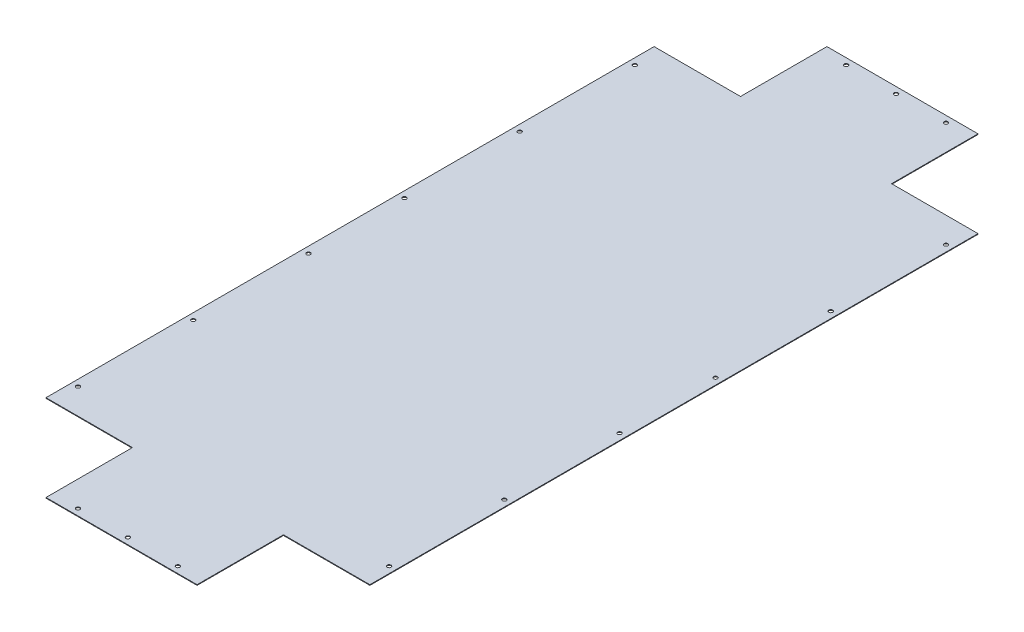
ISO-10303-21;
HEADER;
FILE_DESCRIPTION(('STEP AP214'),'2;1');
FILE_NAME('part.step','',(''),(''),'','','');
FILE_SCHEMA(('AUTOMOTIVE_DESIGN { 1 0 10303 214 1 1 1 1 }'));
ENDSEC;
DATA;
#1=APPLICATION_CONTEXT('core data for automotive mechanical design processes');
#2=APPLICATION_PROTOCOL_DEFINITION('international standard','automotive_design',2000,#1);
#3=PRODUCT_CONTEXT('',#1,'mechanical');
#4=PRODUCT('Part','Part','',(#3));
#5=PRODUCT_RELATED_PRODUCT_CATEGORY('part','',(#4));
#6=PRODUCT_DEFINITION_FORMATION('','',#4);
#7=PRODUCT_DEFINITION_CONTEXT('part definition',#1,'design');
#8=PRODUCT_DEFINITION('design','',#6,#7);
#9=PRODUCT_DEFINITION_SHAPE('','',#8);
#10=(LENGTH_UNIT() NAMED_UNIT(*) SI_UNIT(.MILLI.,.METRE.));
#11=(NAMED_UNIT(*) PLANE_ANGLE_UNIT() SI_UNIT($,.RADIAN.));
#12=(NAMED_UNIT(*) SI_UNIT($,.STERADIAN.) SOLID_ANGLE_UNIT());
#13=UNCERTAINTY_MEASURE_WITH_UNIT(LENGTH_MEASURE(1.E-05),#10,'distance_accuracy_value','');
#14=(GEOMETRIC_REPRESENTATION_CONTEXT(3) GLOBAL_UNCERTAINTY_ASSIGNED_CONTEXT((#13)) GLOBAL_UNIT_ASSIGNED_CONTEXT((#10,
#11,#12)) REPRESENTATION_CONTEXT('',''));
#15=CARTESIAN_POINT('',(0.,0.,0.));
#16=DIRECTION('',(0.,0.,1.));
#17=DIRECTION('',(1.,0.,0.));
#18=AXIS2_PLACEMENT_3D('',#15,#16,#17);
#19=CARTESIAN_POINT('',(135.,-1.,-1220.));
#20=DIRECTION('',(-1.,0.,0.));
#21=DIRECTION('',(0.,0.,1.));
#22=AXIS2_PLACEMENT_3D('',#19,#20,#21);
#23=PLANE('',#22);
#24=DIRECTION('',(0.,0.,1.));
#25=VECTOR('',#24,1.);
#26=CARTESIAN_POINT('',(135.,0.,-1220.));
#27=LINE('',#26,#25);
#28=CARTESIAN_POINT('',(135.,0.,-1220.));
#29=VERTEX_POINT('',#28);
#30=CARTESIAN_POINT('',(135.,0.,-1085.));
#31=VERTEX_POINT('',#30);
#32=EDGE_CURVE('E158',#29,#31,#27,.T.);
#33=ORIENTED_EDGE('',*,*,#32,.F.);
#34=DIRECTION('',(0.,1.,0.));
#35=VECTOR('',#34,1.);
#36=CARTESIAN_POINT('',(135.,-1.,-1220.));
#37=LINE('',#36,#35);
#38=CARTESIAN_POINT('',(135.,-1.,-1220.));
#39=VERTEX_POINT('',#38);
#40=EDGE_CURVE('E11',#39,#29,#37,.T.);
#41=ORIENTED_EDGE('',*,*,#40,.F.);
#42=DIRECTION('',(0.,0.,1.));
#43=VECTOR('',#42,1.);
#44=CARTESIAN_POINT('',(135.,-1.,-1220.));
#45=LINE('',#44,#43);
#46=CARTESIAN_POINT('',(135.,-1.,-1085.));
#47=VERTEX_POINT('',#46);
#48=EDGE_CURVE('E191',#39,#47,#45,.T.);
#49=ORIENTED_EDGE('',*,*,#48,.T.);
#50=DIRECTION('',(0.,1.,0.));
#51=VECTOR('',#50,1.);
#52=CARTESIAN_POINT('',(135.,-1.,-1085.));
#53=LINE('',#52,#51);
#54=EDGE_CURVE('E40',#47,#31,#53,.T.);
#55=ORIENTED_EDGE('',*,*,#54,.T.);
#56=EDGE_LOOP('',(#33,#41,#49,#55));
#57=FACE_BOUND('',#56,.T.);
#58=ADVANCED_FACE('F37',(#57),#23,.T.);
#59=CARTESIAN_POINT('',(135.,-1.,-1220.));
#60=DIRECTION('',(0.,0.,-1.));
#61=DIRECTION('',(-1.,0.,0.));
#62=AXIS2_PLACEMENT_3D('',#59,#60,#61);
#63=PLANE('',#62);
#64=DIRECTION('',(-1.,0.,0.));
#65=VECTOR('',#64,1.);
#66=CARTESIAN_POINT('',(135.,0.,-1220.));
#67=LINE('',#66,#65);
#68=CARTESIAN_POINT('',(371.,0.,-1220.));
#69=VERTEX_POINT('',#68);
#70=EDGE_CURVE('E189',#69,#29,#67,.T.);
#71=ORIENTED_EDGE('',*,*,#70,.F.);
#72=DIRECTION('',(0.,1.,0.));
#73=VECTOR('',#72,1.);
#74=CARTESIAN_POINT('',(371.,-1.,-1220.));
#75=LINE('',#74,#73);
#76=CARTESIAN_POINT('',(371.,-1.,-1220.));
#77=VERTEX_POINT('',#76);
#78=EDGE_CURVE('E46',#77,#69,#75,.T.);
#79=ORIENTED_EDGE('',*,*,#78,.F.);
#80=DIRECTION('',(-1.,0.,0.));
#81=VECTOR('',#80,1.);
#82=CARTESIAN_POINT('',(135.,-1.,-1220.));
#83=LINE('',#82,#81);
#84=EDGE_CURVE('E148',#77,#39,#83,.T.);
#85=ORIENTED_EDGE('',*,*,#84,.T.);
#86=ORIENTED_EDGE('',*,*,#40,.T.);
#87=EDGE_LOOP('',(#71,#79,#85,#86));
#88=FACE_BOUND('',#87,.T.);
#89=ADVANCED_FACE('F211',(#88),#63,.T.);
#90=CARTESIAN_POINT('',(371.,-1.,-1220.));
#91=DIRECTION('',(1.,0.,0.));
#92=DIRECTION('',(0.,0.,-1.));
#93=AXIS2_PLACEMENT_3D('',#90,#91,#92);
#94=PLANE('',#93);
#95=DIRECTION('',(0.,0.,-1.));
#96=VECTOR('',#95,1.);
#97=CARTESIAN_POINT('',(371.,0.,-1220.));
#98=LINE('',#97,#96);
#99=CARTESIAN_POINT('',(371.,0.,-1085.));
#100=VERTEX_POINT('',#99);
#101=EDGE_CURVE('E135',#100,#69,#98,.T.);
#102=ORIENTED_EDGE('',*,*,#101,.F.);
#103=DIRECTION('',(0.,1.,0.));
#104=VECTOR('',#103,1.);
#105=CARTESIAN_POINT('',(371.,-1.,-1085.));
#106=LINE('',#105,#104);
#107=CARTESIAN_POINT('',(371.,-1.,-1085.));
#108=VERTEX_POINT('',#107);
#109=EDGE_CURVE('E130',#108,#100,#106,.T.);
#110=ORIENTED_EDGE('',*,*,#109,.F.);
#111=DIRECTION('',(0.,0.,-1.));
#112=VECTOR('',#111,1.);
#113=CARTESIAN_POINT('',(371.,-1.,-1220.));
#114=LINE('',#113,#112);
#115=EDGE_CURVE('E133',#108,#77,#114,.T.);
#116=ORIENTED_EDGE('',*,*,#115,.T.);
#117=ORIENTED_EDGE('',*,*,#78,.T.);
#118=EDGE_LOOP('',(#102,#110,#116,#117));
#119=FACE_BOUND('',#118,.T.);
#120=ADVANCED_FACE('F132',(#119),#94,.T.);
#121=CARTESIAN_POINT('',(506.,-1.,-1085.));
#122=DIRECTION('',(0.,0.,-1.));
#123=DIRECTION('',(-1.,0.,0.));
#124=AXIS2_PLACEMENT_3D('',#121,#122,#123);
#125=PLANE('',#124);
#126=DIRECTION('',(-1.,0.,0.));
#127=VECTOR('',#126,1.);
#128=CARTESIAN_POINT('',(506.,0.,-1085.));
#129=LINE('',#128,#127);
#130=CARTESIAN_POINT('',(506.,0.,-1085.));
#131=VERTEX_POINT('',#130);
#132=EDGE_CURVE('E186',#131,#100,#129,.T.);
#133=ORIENTED_EDGE('',*,*,#132,.F.);
#134=DIRECTION('',(0.,1.,0.));
#135=VECTOR('',#134,1.);
#136=CARTESIAN_POINT('',(506.,-1.,-1085.));
#137=LINE('',#136,#135);
#138=CARTESIAN_POINT('',(506.,-1.,-1085.));
#139=VERTEX_POINT('',#138);
#140=EDGE_CURVE('E140',#139,#131,#137,.T.);
#141=ORIENTED_EDGE('',*,*,#140,.F.);
#142=DIRECTION('',(-1.,0.,0.));
#143=VECTOR('',#142,1.);
#144=CARTESIAN_POINT('',(506.,-1.,-1085.));
#145=LINE('',#144,#143);
#146=EDGE_CURVE('E146',#139,#108,#145,.T.);
#147=ORIENTED_EDGE('',*,*,#146,.T.);
#148=ORIENTED_EDGE('',*,*,#109,.T.);
#149=EDGE_LOOP('',(#133,#141,#147,#148));
#150=FACE_BOUND('',#149,.T.);
#151=ADVANCED_FACE('F150',(#150),#125,.T.);
#152=CARTESIAN_POINT('',(506.,-1.,-135.));
#153=DIRECTION('',(1.,0.,0.));
#154=DIRECTION('',(0.,0.,-1.));
#155=AXIS2_PLACEMENT_3D('',#152,#153,#154);
#156=PLANE('',#155);
#157=DIRECTION('',(0.,0.,-1.));
#158=VECTOR('',#157,1.);
#159=CARTESIAN_POINT('',(506.,0.,-135.));
#160=LINE('',#159,#158);
#161=CARTESIAN_POINT('',(506.,0.,-135.));
#162=VERTEX_POINT('',#161);
#163=EDGE_CURVE('E183',#162,#131,#160,.T.);
#164=ORIENTED_EDGE('',*,*,#163,.F.);
#165=DIRECTION('',(0.,1.,0.));
#166=VECTOR('',#165,1.);
#167=CARTESIAN_POINT('',(506.,-1.,-135.));
#168=LINE('',#167,#166);
#169=CARTESIAN_POINT('',(506.,-1.,-135.));
#170=VERTEX_POINT('',#169);
#171=EDGE_CURVE('E195',#170,#162,#168,.T.);
#172=ORIENTED_EDGE('',*,*,#171,.F.);
#173=DIRECTION('',(0.,0.,-1.));
#174=VECTOR('',#173,1.);
#175=CARTESIAN_POINT('',(506.,-1.,-135.));
#176=LINE('',#175,#174);
#177=EDGE_CURVE('E151',#170,#139,#176,.T.);
#178=ORIENTED_EDGE('',*,*,#177,.T.);
#179=ORIENTED_EDGE('',*,*,#140,.T.);
#180=EDGE_LOOP('',(#164,#172,#178,#179));
#181=FACE_BOUND('',#180,.T.);
#182=ADVANCED_FACE('F224',(#181),#156,.T.);
#183=CARTESIAN_POINT('',(506.,-1.,-135.));
#184=DIRECTION('',(0.,0.,1.));
#185=DIRECTION('',(1.,0.,0.));
#186=AXIS2_PLACEMENT_3D('',#183,#184,#185);
#187=PLANE('',#186);
#188=DIRECTION('',(1.,0.,0.));
#189=VECTOR('',#188,1.);
#190=CARTESIAN_POINT('',(506.,0.,-135.));
#191=LINE('',#190,#189);
#192=CARTESIAN_POINT('',(371.,0.,-135.));
#193=VERTEX_POINT('',#192);
#194=EDGE_CURVE('E180',#193,#162,#191,.T.);
#195=ORIENTED_EDGE('',*,*,#194,.F.);
#196=DIRECTION('',(0.,1.,0.));
#197=VECTOR('',#196,1.);
#198=CARTESIAN_POINT('',(371.,-1.,-135.));
#199=LINE('',#198,#197);
#200=CARTESIAN_POINT('',(371.,-1.,-135.));
#201=VERTEX_POINT('',#200);
#202=EDGE_CURVE('E197',#201,#193,#199,.T.);
#203=ORIENTED_EDGE('',*,*,#202,.F.);
#204=DIRECTION('',(1.,0.,0.));
#205=VECTOR('',#204,1.);
#206=CARTESIAN_POINT('',(506.,-1.,-135.));
#207=LINE('',#206,#205);
#208=EDGE_CURVE('E153',#201,#170,#207,.T.);
#209=ORIENTED_EDGE('',*,*,#208,.T.);
#210=ORIENTED_EDGE('',*,*,#171,.T.);
#211=EDGE_LOOP('',(#195,#203,#209,#210));
#212=FACE_BOUND('',#211,.T.);
#213=ADVANCED_FACE('F227',(#212),#187,.T.);
#214=CARTESIAN_POINT('',(371.,-1.,0.));
#215=DIRECTION('',(1.,0.,0.));
#216=DIRECTION('',(0.,0.,-1.));
#217=AXIS2_PLACEMENT_3D('',#214,#215,#216);
#218=PLANE('',#217);
#219=DIRECTION('',(0.,0.,-1.));
#220=VECTOR('',#219,1.);
#221=CARTESIAN_POINT('',(371.,0.,0.));
#222=LINE('',#221,#220);
#223=CARTESIAN_POINT('',(371.,0.,0.));
#224=VERTEX_POINT('',#223);
#225=EDGE_CURVE('E177',#224,#193,#222,.T.);
#226=ORIENTED_EDGE('',*,*,#225,.F.);
#227=DIRECTION('',(0.,1.,0.));
#228=VECTOR('',#227,1.);
#229=CARTESIAN_POINT('',(371.,-1.,0.));
#230=LINE('',#229,#228);
#231=CARTESIAN_POINT('',(371.,-1.,0.));
#232=VERTEX_POINT('',#231);
#233=EDGE_CURVE('E199',#232,#224,#230,.T.);
#234=ORIENTED_EDGE('',*,*,#233,.F.);
#235=DIRECTION('',(0.,0.,-1.));
#236=VECTOR('',#235,1.);
#237=CARTESIAN_POINT('',(371.,-1.,0.));
#238=LINE('',#237,#236);
#239=EDGE_CURVE('E412',#232,#201,#238,.T.);
#240=ORIENTED_EDGE('',*,*,#239,.T.);
#241=ORIENTED_EDGE('',*,*,#202,.T.);
#242=EDGE_LOOP('',(#226,#234,#240,#241));
#243=FACE_BOUND('',#242,.T.);
#244=ADVANCED_FACE('F231',(#243),#218,.T.);
#245=CARTESIAN_POINT('',(135.,-1.,0.));
#246=DIRECTION('',(0.,0.,1.));
#247=DIRECTION('',(1.,0.,0.));
#248=AXIS2_PLACEMENT_3D('',#245,#246,#247);
#249=PLANE('',#248);
#250=DIRECTION('',(1.,0.,0.));
#251=VECTOR('',#250,1.);
#252=CARTESIAN_POINT('',(135.,0.,0.));
#253=LINE('',#252,#251);
#254=CARTESIAN_POINT('',(135.,0.,0.));
#255=VERTEX_POINT('',#254);
#256=EDGE_CURVE('E174',#255,#224,#253,.T.);
#257=ORIENTED_EDGE('',*,*,#256,.F.);
#258=DIRECTION('',(0.,1.,0.));
#259=VECTOR('',#258,1.);
#260=CARTESIAN_POINT('',(135.,-1.,0.));
#261=LINE('',#260,#259);
#262=CARTESIAN_POINT('',(135.,-1.,0.));
#263=VERTEX_POINT('',#262);
#264=EDGE_CURVE('E201',#263,#255,#261,.T.);
#265=ORIENTED_EDGE('',*,*,#264,.F.);
#266=DIRECTION('',(1.,0.,0.));
#267=VECTOR('',#266,1.);
#268=CARTESIAN_POINT('',(135.,-1.,0.));
#269=LINE('',#268,#267);
#270=EDGE_CURVE('E409',#263,#232,#269,.T.);
#271=ORIENTED_EDGE('',*,*,#270,.T.);
#272=ORIENTED_EDGE('',*,*,#233,.T.);
#273=EDGE_LOOP('',(#257,#265,#271,#272));
#274=FACE_BOUND('',#273,.T.);
#275=ADVANCED_FACE('F235',(#274),#249,.T.);
#276=CARTESIAN_POINT('',(135.,-1.,0.));
#277=DIRECTION('',(-1.,0.,0.));
#278=DIRECTION('',(0.,0.,1.));
#279=AXIS2_PLACEMENT_3D('',#276,#277,#278);
#280=PLANE('',#279);
#281=DIRECTION('',(0.,0.,1.));
#282=VECTOR('',#281,1.);
#283=CARTESIAN_POINT('',(135.,0.,0.));
#284=LINE('',#283,#282);
#285=CARTESIAN_POINT('',(135.,0.,-135.));
#286=VERTEX_POINT('',#285);
#287=EDGE_CURVE('E171',#286,#255,#284,.T.);
#288=ORIENTED_EDGE('',*,*,#287,.F.);
#289=DIRECTION('',(0.,1.,0.));
#290=VECTOR('',#289,1.);
#291=CARTESIAN_POINT('',(135.,-1.,-135.));
#292=LINE('',#291,#290);
#293=CARTESIAN_POINT('',(135.,-1.,-135.));
#294=VERTEX_POINT('',#293);
#295=EDGE_CURVE('E203',#294,#286,#292,.T.);
#296=ORIENTED_EDGE('',*,*,#295,.F.);
#297=DIRECTION('',(0.,0.,1.));
#298=VECTOR('',#297,1.);
#299=CARTESIAN_POINT('',(135.,-1.,0.));
#300=LINE('',#299,#298);
#301=EDGE_CURVE('E406',#294,#263,#300,.T.);
#302=ORIENTED_EDGE('',*,*,#301,.T.);
#303=ORIENTED_EDGE('',*,*,#264,.T.);
#304=EDGE_LOOP('',(#288,#296,#302,#303));
#305=FACE_BOUND('',#304,.T.);
#306=ADVANCED_FACE('F239',(#305),#280,.T.);
#307=CARTESIAN_POINT('',(0.,-1.,-135.));
#308=DIRECTION('',(0.,0.,1.));
#309=DIRECTION('',(1.,0.,0.));
#310=AXIS2_PLACEMENT_3D('',#307,#308,#309);
#311=PLANE('',#310);
#312=DIRECTION('',(1.,0.,0.));
#313=VECTOR('',#312,1.);
#314=CARTESIAN_POINT('',(0.,0.,-135.));
#315=LINE('',#314,#313);
#316=CARTESIAN_POINT('',(0.,0.,-135.));
#317=VERTEX_POINT('',#316);
#318=EDGE_CURVE('E168',#317,#286,#315,.T.);
#319=ORIENTED_EDGE('',*,*,#318,.F.);
#320=DIRECTION('',(0.,1.,0.));
#321=VECTOR('',#320,1.);
#322=CARTESIAN_POINT('',(0.,-1.,-135.));
#323=LINE('',#322,#321);
#324=CARTESIAN_POINT('',(0.,-1.,-135.));
#325=VERTEX_POINT('',#324);
#326=EDGE_CURVE('E205',#325,#317,#323,.T.);
#327=ORIENTED_EDGE('',*,*,#326,.F.);
#328=DIRECTION('',(1.,0.,0.));
#329=VECTOR('',#328,1.);
#330=CARTESIAN_POINT('',(0.,-1.,-135.));
#331=LINE('',#330,#329);
#332=EDGE_CURVE('E403',#325,#294,#331,.T.);
#333=ORIENTED_EDGE('',*,*,#332,.T.);
#334=ORIENTED_EDGE('',*,*,#295,.T.);
#335=EDGE_LOOP('',(#319,#327,#333,#334));
#336=FACE_BOUND('',#335,.T.);
#337=ADVANCED_FACE('F243',(#336),#311,.T.);
#338=CARTESIAN_POINT('',(0.,-1.,-135.));
#339=DIRECTION('',(-1.,0.,0.));
#340=DIRECTION('',(0.,0.,1.));
#341=AXIS2_PLACEMENT_3D('',#338,#339,#340);
#342=PLANE('',#341);
#343=DIRECTION('',(0.,0.,1.));
#344=VECTOR('',#343,1.);
#345=CARTESIAN_POINT('',(0.,0.,-135.));
#346=LINE('',#345,#344);
#347=CARTESIAN_POINT('',(0.,0.,-1085.));
#348=VERTEX_POINT('',#347);
#349=EDGE_CURVE('E165',#348,#317,#346,.T.);
#350=ORIENTED_EDGE('',*,*,#349,.F.);
#351=DIRECTION('',(0.,1.,0.));
#352=VECTOR('',#351,1.);
#353=CARTESIAN_POINT('',(0.,-1.,-1085.));
#354=LINE('',#353,#352);
#355=CARTESIAN_POINT('',(0.,-1.,-1085.));
#356=VERTEX_POINT('',#355);
#357=EDGE_CURVE('E206',#356,#348,#354,.T.);
#358=ORIENTED_EDGE('',*,*,#357,.F.);
#359=DIRECTION('',(0.,0.,1.));
#360=VECTOR('',#359,1.);
#361=CARTESIAN_POINT('',(0.,-1.,-135.));
#362=LINE('',#361,#360);
#363=EDGE_CURVE('E400',#356,#325,#362,.T.);
#364=ORIENTED_EDGE('',*,*,#363,.T.);
#365=ORIENTED_EDGE('',*,*,#326,.T.);
#366=EDGE_LOOP('',(#350,#358,#364,#365));
#367=FACE_BOUND('',#366,.T.);
#368=ADVANCED_FACE('F247',(#367),#342,.T.);
#369=CARTESIAN_POINT('',(0.,-1.,-1085.));
#370=DIRECTION('',(0.,0.,-1.));
#371=DIRECTION('',(-1.,0.,0.));
#372=AXIS2_PLACEMENT_3D('',#369,#370,#371);
#373=PLANE('',#372);
#374=DIRECTION('',(-1.,0.,0.));
#375=VECTOR('',#374,1.);
#376=CARTESIAN_POINT('',(0.,0.,-1085.));
#377=LINE('',#376,#375);
#378=EDGE_CURVE('E161',#31,#348,#377,.T.);
#379=ORIENTED_EDGE('',*,*,#378,.F.);
#380=ORIENTED_EDGE('',*,*,#54,.F.);
#381=DIRECTION('',(-1.,0.,0.));
#382=VECTOR('',#381,1.);
#383=CARTESIAN_POINT('',(0.,-1.,-1085.));
#384=LINE('',#383,#382);
#385=EDGE_CURVE('E398',#47,#356,#384,.T.);
#386=ORIENTED_EDGE('',*,*,#385,.T.);
#387=ORIENTED_EDGE('',*,*,#357,.T.);
#388=EDGE_LOOP('',(#379,#380,#386,#387));
#389=FACE_BOUND('',#388,.T.);
#390=ADVANCED_FACE('F208',(#389),#373,.T.);
#391=CARTESIAN_POINT('',(0.,-1.,0.));
#392=DIRECTION('',(0.,1.,0.));
#393=DIRECTION('',(0.,0.,1.));
#394=AXIS2_PLACEMENT_3D('',#391,#392,#393);
#395=PLANE('',#394);
#396=CARTESIAN_POINT('',(253.,-0.999999999999999,-1209.99729801336));
#397=DIRECTION('',(0.,1.,0.));
#398=DIRECTION('',(0.,0.,1.));
#399=AXIS2_PLACEMENT_3D('',#396,#397,#398);
#400=CIRCLE('',#399,2.99999999999999);
#401=CARTESIAN_POINT('',(253.,-0.999999999999999,-1206.99729801336));
#402=VERTEX_POINT('',#401);
#403=EDGE_CURVE('E162',#402,#402,#400,.T.);
#404=ORIENTED_EDGE('',*,*,#403,.T.);
#405=EDGE_LOOP('',(#404));
#406=FACE_BOUND('',#405,.T.);
#407=CARTESIAN_POINT('',(10.0000000000001,-0.999999999999999,-1045.));
#408=DIRECTION('',(0.,1.,0.));
#409=DIRECTION('',(0.,0.,1.));
#410=AXIS2_PLACEMENT_3D('',#407,#408,#409);
#411=CIRCLE('',#410,2.99999999999997);
#412=CARTESIAN_POINT('',(10.0000000000001,-0.999999999999999,-1042.));
#413=VERTEX_POINT('',#412);
#414=EDGE_CURVE('E393',#413,#413,#411,.T.);
#415=ORIENTED_EDGE('',*,*,#414,.T.);
#416=EDGE_LOOP('',(#415));
#417=FACE_BOUND('',#416,.T.);
#418=CARTESIAN_POINT('',(9.99999999999823,-0.999999999999999,-865.));
#419=DIRECTION('',(0.,1.,0.));
#420=DIRECTION('',(0.,0.,1.));
#421=AXIS2_PLACEMENT_3D('',#418,#419,#420);
#422=CIRCLE('',#421,2.99999999999999);
#423=CARTESIAN_POINT('',(9.99999999999823,-0.999999999999999,-862.));
#424=VERTEX_POINT('',#423);
#425=EDGE_CURVE('E390',#424,#424,#422,.T.);
#426=ORIENTED_EDGE('',*,*,#425,.T.);
#427=EDGE_LOOP('',(#426));
#428=FACE_BOUND('',#427,.T.);
#429=CARTESIAN_POINT('',(9.99999999999634,-0.999999999999999,-685.));
#430=DIRECTION('',(0.,1.,0.));
#431=DIRECTION('',(0.,0.,1.));
#432=AXIS2_PLACEMENT_3D('',#429,#430,#431);
#433=CIRCLE('',#432,3.00000000000001);
#434=CARTESIAN_POINT('',(9.99999999999634,-0.999999999999999,-682.));
#435=VERTEX_POINT('',#434);
#436=EDGE_CURVE('E387',#435,#435,#433,.T.);
#437=ORIENTED_EDGE('',*,*,#436,.T.);
#438=EDGE_LOOP('',(#437));
#439=FACE_BOUND('',#438,.T.);
#440=CARTESIAN_POINT('',(331.,-0.999999999999999,-1210.));
#441=DIRECTION('',(0.,1.,0.));
#442=DIRECTION('',(0.,0.,1.));
#443=AXIS2_PLACEMENT_3D('',#440,#441,#442);
#444=CIRCLE('',#443,2.99999999999999);
#445=CARTESIAN_POINT('',(331.,-0.999999999999999,-1207.));
#446=VERTEX_POINT('',#445);
#447=EDGE_CURVE('E384',#446,#446,#444,.T.);
#448=ORIENTED_EDGE('',*,*,#447,.T.);
#449=EDGE_LOOP('',(#448));
#450=FACE_BOUND('',#449,.T.);
#451=CARTESIAN_POINT('',(496.000000000002,-0.999999999999999,-865.));
#452=DIRECTION('',(0.,1.,0.));
#453=DIRECTION('',(0.,0.,1.));
#454=AXIS2_PLACEMENT_3D('',#451,#452,#453);
#455=CIRCLE('',#454,2.99999999999999);
#456=CARTESIAN_POINT('',(496.000000000002,-0.999999999999999,-862.));
#457=VERTEX_POINT('',#456);
#458=EDGE_CURVE('E381',#457,#457,#455,.T.);
#459=ORIENTED_EDGE('',*,*,#458,.T.);
#460=EDGE_LOOP('',(#459));
#461=FACE_BOUND('',#460,.T.);
#462=CARTESIAN_POINT('',(496.000000000004,-0.999999999999999,-685.));
#463=DIRECTION('',(0.,1.,0.));
#464=DIRECTION('',(0.,0.,1.));
#465=AXIS2_PLACEMENT_3D('',#462,#463,#464);
#466=CIRCLE('',#465,2.99999999999999);
#467=CARTESIAN_POINT('',(496.000000000004,-0.999999999999999,-682.));
#468=VERTEX_POINT('',#467);
#469=EDGE_CURVE('E378',#468,#468,#466,.T.);
#470=ORIENTED_EDGE('',*,*,#469,.T.);
#471=EDGE_LOOP('',(#470));
#472=FACE_BOUND('',#471,.T.);
#473=CARTESIAN_POINT('',(175.,-0.999999999999999,-1210.));
#474=DIRECTION('',(0.,1.,0.));
#475=DIRECTION('',(0.,0.,1.));
#476=AXIS2_PLACEMENT_3D('',#473,#474,#475);
#477=CIRCLE('',#476,2.99999999999999);
#478=CARTESIAN_POINT('',(175.,-0.999999999999999,-1207.));
#479=VERTEX_POINT('',#478);
#480=EDGE_CURVE('E375',#479,#479,#477,.T.);
#481=ORIENTED_EDGE('',*,*,#480,.T.);
#482=EDGE_LOOP('',(#481));
#483=FACE_BOUND('',#482,.T.);
#484=CARTESIAN_POINT('',(496.000000000002,-0.999999999999999,-355.));
#485=DIRECTION('',(0.,1.,0.));
#486=DIRECTION('',(0.,0.,1.));
#487=AXIS2_PLACEMENT_3D('',#484,#485,#486);
#488=CIRCLE('',#487,2.99999999999999);
#489=CARTESIAN_POINT('',(496.000000000002,-0.999999999999999,-352.));
#490=VERTEX_POINT('',#489);
#491=EDGE_CURVE('E372',#490,#490,#488,.T.);
#492=ORIENTED_EDGE('',*,*,#491,.T.);
#493=EDGE_LOOP('',(#492));
#494=FACE_BOUND('',#493,.T.);
#495=CARTESIAN_POINT('',(496.000000000004,-0.999999999999999,-535.));
#496=DIRECTION('',(0.,1.,0.));
#497=DIRECTION('',(0.,0.,1.));
#498=AXIS2_PLACEMENT_3D('',#495,#496,#497);
#499=CIRCLE('',#498,2.99999999999999);
#500=CARTESIAN_POINT('',(496.000000000004,-0.999999999999999,-532.));
#501=VERTEX_POINT('',#500);
#502=EDGE_CURVE('E369',#501,#501,#499,.T.);
#503=ORIENTED_EDGE('',*,*,#502,.T.);
#504=EDGE_LOOP('',(#503));
#505=FACE_BOUND('',#504,.T.);
#506=CARTESIAN_POINT('',(331.,-0.999999999999999,-10.));
#507=DIRECTION('',(0.,1.,0.));
#508=DIRECTION('',(0.,0.,1.));
#509=AXIS2_PLACEMENT_3D('',#506,#507,#508);
#510=CIRCLE('',#509,2.99999999999999);
#511=CARTESIAN_POINT('',(331.,-0.999999999999999,-7.00000000000002));
#512=VERTEX_POINT('',#511);
#513=EDGE_CURVE('E366',#512,#512,#510,.T.);
#514=ORIENTED_EDGE('',*,*,#513,.T.);
#515=EDGE_LOOP('',(#514));
#516=FACE_BOUND('',#515,.T.);
#517=CARTESIAN_POINT('',(175.,-0.999999999999999,-10.));
#518=DIRECTION('',(0.,1.,0.));
#519=DIRECTION('',(0.,0.,1.));
#520=AXIS2_PLACEMENT_3D('',#517,#518,#519);
#521=CIRCLE('',#520,2.99999999999999);
#522=CARTESIAN_POINT('',(175.,-0.999999999999999,-7.00000000000002));
#523=VERTEX_POINT('',#522);
#524=EDGE_CURVE('E363',#523,#523,#521,.T.);
#525=ORIENTED_EDGE('',*,*,#524,.T.);
#526=EDGE_LOOP('',(#525));
#527=FACE_BOUND('',#526,.T.);
#528=CARTESIAN_POINT('',(9.99999999999634,-0.999999999999999,-535.));
#529=DIRECTION('',(0.,1.,0.));
#530=DIRECTION('',(0.,0.,1.));
#531=AXIS2_PLACEMENT_3D('',#528,#529,#530);
#532=CIRCLE('',#531,3.00000000000001);
#533=CARTESIAN_POINT('',(9.99999999999634,-0.999999999999999,-532.));
#534=VERTEX_POINT('',#533);
#535=EDGE_CURVE('E360',#534,#534,#532,.T.);
#536=ORIENTED_EDGE('',*,*,#535,.T.);
#537=EDGE_LOOP('',(#536));
#538=FACE_BOUND('',#537,.T.);
#539=CARTESIAN_POINT('',(9.99999999999823,-0.999999999999999,-355.));
#540=DIRECTION('',(0.,1.,0.));
#541=DIRECTION('',(0.,0.,1.));
#542=AXIS2_PLACEMENT_3D('',#539,#540,#541);
#543=CIRCLE('',#542,2.99999999999999);
#544=CARTESIAN_POINT('',(9.99999999999823,-0.999999999999999,-352.));
#545=VERTEX_POINT('',#544);
#546=EDGE_CURVE('E357',#545,#545,#543,.T.);
#547=ORIENTED_EDGE('',*,*,#546,.T.);
#548=EDGE_LOOP('',(#547));
#549=FACE_BOUND('',#548,.T.);
#550=CARTESIAN_POINT('',(10.0000000000001,-0.999999999999999,-175.));
#551=DIRECTION('',(0.,1.,0.));
#552=DIRECTION('',(0.,0.,1.));
#553=AXIS2_PLACEMENT_3D('',#550,#551,#552);
#554=CIRCLE('',#553,2.99999999999994);
#555=CARTESIAN_POINT('',(10.0000000000001,-0.999999999999999,-172.));
#556=VERTEX_POINT('',#555);
#557=EDGE_CURVE('E348',#556,#556,#554,.T.);
#558=ORIENTED_EDGE('',*,*,#557,.T.);
#559=EDGE_LOOP('',(#558));
#560=FACE_BOUND('',#559,.T.);
#561=CARTESIAN_POINT('',(253.,-0.999999999999999,-10.002701986636));
#562=DIRECTION('',(0.,1.,0.));
#563=DIRECTION('',(0.,0.,1.));
#564=AXIS2_PLACEMENT_3D('',#561,#562,#563);
#565=CIRCLE('',#564,2.99999999999999);
#566=CARTESIAN_POINT('',(253.,-0.999999999999999,-7.002701986636));
#567=VERTEX_POINT('',#566);
#568=EDGE_CURVE('E344',#567,#567,#565,.T.);
#569=ORIENTED_EDGE('',*,*,#568,.T.);
#570=EDGE_LOOP('',(#569));
#571=FACE_BOUND('',#570,.T.);
#572=CARTESIAN_POINT('',(496.,-0.999999999999999,-175.));
#573=DIRECTION('',(0.,1.,0.));
#574=DIRECTION('',(0.,0.,1.));
#575=AXIS2_PLACEMENT_3D('',#572,#573,#574);
#576=CIRCLE('',#575,2.99999999999999);
#577=CARTESIAN_POINT('',(496.,-0.999999999999999,-172.));
#578=VERTEX_POINT('',#577);
#579=EDGE_CURVE('E342',#578,#578,#576,.T.);
#580=ORIENTED_EDGE('',*,*,#579,.T.);
#581=EDGE_LOOP('',(#580));
#582=FACE_BOUND('',#581,.T.);
#583=CARTESIAN_POINT('',(496.,-0.999999999999999,-1045.));
#584=DIRECTION('',(0.,1.,0.));
#585=DIRECTION('',(0.,0.,1.));
#586=AXIS2_PLACEMENT_3D('',#583,#584,#585);
#587=CIRCLE('',#586,2.99999999999999);
#588=CARTESIAN_POINT('',(496.,-0.999999999999999,-1042.));
#589=VERTEX_POINT('',#588);
#590=EDGE_CURVE('E345',#589,#589,#587,.T.);
#591=ORIENTED_EDGE('',*,*,#590,.T.);
#592=EDGE_LOOP('',(#591));
#593=FACE_BOUND('',#592,.T.);
#594=ORIENTED_EDGE('',*,*,#48,.F.);
#595=ORIENTED_EDGE('',*,*,#84,.F.);
#596=ORIENTED_EDGE('',*,*,#115,.F.);
#597=ORIENTED_EDGE('',*,*,#146,.F.);
#598=ORIENTED_EDGE('',*,*,#177,.F.);
#599=ORIENTED_EDGE('',*,*,#208,.F.);
#600=ORIENTED_EDGE('',*,*,#239,.F.);
#601=ORIENTED_EDGE('',*,*,#270,.F.);
#602=ORIENTED_EDGE('',*,*,#301,.F.);
#603=ORIENTED_EDGE('',*,*,#332,.F.);
#604=ORIENTED_EDGE('',*,*,#363,.F.);
#605=ORIENTED_EDGE('',*,*,#385,.F.);
#606=EDGE_LOOP('',(#594,#595,#596,#597,#598,#599,#600,#601,#602,#603,#604,#605));
#607=FACE_BOUND('',#606,.T.);
#608=ADVANCED_FACE('F144',(#406,#417,#428,#439,#450,#461,#472,#483,#494,#505,#516,#527,#538,
#549,#560,#571,#582,#593,#607),#395,.F.);
#609=CARTESIAN_POINT('',(0.,0.,0.));
#610=DIRECTION('',(0.,1.,0.));
#611=DIRECTION('',(0.,0.,1.));
#612=AXIS2_PLACEMENT_3D('',#609,#610,#611);
#613=PLANE('',#612);
#614=CARTESIAN_POINT('',(253.,0.,-1209.99729801336));
#615=DIRECTION('',(0.,1.,0.));
#616=DIRECTION('',(0.,0.,1.));
#617=AXIS2_PLACEMENT_3D('',#614,#615,#616);
#618=CIRCLE('',#617,2.99999999999999);
#619=CARTESIAN_POINT('',(253.,0.,-1206.99729801336));
#620=VERTEX_POINT('',#619);
#621=EDGE_CURVE('E492',#620,#620,#618,.T.);
#622=ORIENTED_EDGE('',*,*,#621,.F.);
#623=EDGE_LOOP('',(#622));
#624=FACE_BOUND('',#623,.T.);
#625=CARTESIAN_POINT('',(10.0000000000001,0.,-1045.));
#626=DIRECTION('',(0.,1.,0.));
#627=DIRECTION('',(0.,0.,-1.));
#628=AXIS2_PLACEMENT_3D('',#625,#626,#627);
#629=CIRCLE('',#628,2.99999999999997);
#630=CARTESIAN_POINT('',(10.0000000000001,0.,-1048.));
#631=VERTEX_POINT('',#630);
#632=EDGE_CURVE('E518',#631,#631,#629,.T.);
#633=ORIENTED_EDGE('',*,*,#632,.F.);
#634=EDGE_LOOP('',(#633));
#635=FACE_BOUND('',#634,.T.);
#636=CARTESIAN_POINT('',(9.99999999999823,0.,-865.));
#637=DIRECTION('',(0.,1.,0.));
#638=DIRECTION('',(0.,0.,-1.));
#639=AXIS2_PLACEMENT_3D('',#636,#637,#638);
#640=CIRCLE('',#639,2.99999999999999);
#641=CARTESIAN_POINT('',(9.99999999999823,0.,-868.));
#642=VERTEX_POINT('',#641);
#643=EDGE_CURVE('E521',#642,#642,#640,.T.);
#644=ORIENTED_EDGE('',*,*,#643,.F.);
#645=EDGE_LOOP('',(#644));
#646=FACE_BOUND('',#645,.T.);
#647=CARTESIAN_POINT('',(9.99999999999634,0.,-685.));
#648=DIRECTION('',(0.,1.,0.));
#649=DIRECTION('',(0.,0.,-1.));
#650=AXIS2_PLACEMENT_3D('',#647,#648,#649);
#651=CIRCLE('',#650,3.00000000000001);
#652=CARTESIAN_POINT('',(9.99999999999634,0.,-688.));
#653=VERTEX_POINT('',#652);
#654=EDGE_CURVE('E513',#653,#653,#651,.T.);
#655=ORIENTED_EDGE('',*,*,#654,.F.);
#656=EDGE_LOOP('',(#655));
#657=FACE_BOUND('',#656,.T.);
#658=CARTESIAN_POINT('',(331.,0.,-1210.));
#659=DIRECTION('',(0.,1.,0.));
#660=DIRECTION('',(0.,0.,1.));
#661=AXIS2_PLACEMENT_3D('',#658,#659,#660);
#662=CIRCLE('',#661,2.99999999999999);
#663=CARTESIAN_POINT('',(331.,0.,-1207.));
#664=VERTEX_POINT('',#663);
#665=EDGE_CURVE('E478',#664,#664,#662,.T.);
#666=ORIENTED_EDGE('',*,*,#665,.F.);
#667=EDGE_LOOP('',(#666));
#668=FACE_BOUND('',#667,.T.);
#669=CARTESIAN_POINT('',(496.000000000002,0.,-865.));
#670=DIRECTION('',(0.,1.,0.));
#671=DIRECTION('',(0.,0.,1.));
#672=AXIS2_PLACEMENT_3D('',#669,#670,#671);
#673=CIRCLE('',#672,2.99999999999999);
#674=CARTESIAN_POINT('',(496.000000000002,0.,-862.));
#675=VERTEX_POINT('',#674);
#676=EDGE_CURVE('E504',#675,#675,#673,.T.);
#677=ORIENTED_EDGE('',*,*,#676,.F.);
#678=EDGE_LOOP('',(#677));
#679=FACE_BOUND('',#678,.T.);
#680=CARTESIAN_POINT('',(496.000000000004,0.,-685.));
#681=DIRECTION('',(0.,1.,0.));
#682=DIRECTION('',(0.,0.,1.));
#683=AXIS2_PLACEMENT_3D('',#680,#681,#682);
#684=CIRCLE('',#683,2.99999999999999);
#685=CARTESIAN_POINT('',(496.000000000004,0.,-682.));
#686=VERTEX_POINT('',#685);
#687=EDGE_CURVE('E507',#686,#686,#684,.T.);
#688=ORIENTED_EDGE('',*,*,#687,.F.);
#689=EDGE_LOOP('',(#688));
#690=FACE_BOUND('',#689,.T.);
#691=CARTESIAN_POINT('',(175.,0.,-1210.));
#692=DIRECTION('',(0.,1.,0.));
#693=DIRECTION('',(0.,0.,-1.));
#694=AXIS2_PLACEMENT_3D('',#691,#692,#693);
#695=CIRCLE('',#694,2.99999999999999);
#696=CARTESIAN_POINT('',(175.,0.,-1213.));
#697=VERTEX_POINT('',#696);
#698=EDGE_CURVE('E510',#697,#697,#695,.T.);
#699=ORIENTED_EDGE('',*,*,#698,.F.);
#700=EDGE_LOOP('',(#699));
#701=FACE_BOUND('',#700,.T.);
#702=CARTESIAN_POINT('',(496.000000000002,0.,-355.));
#703=DIRECTION('',(0.,1.,0.));
#704=DIRECTION('',(0.,0.,-1.));
#705=AXIS2_PLACEMENT_3D('',#702,#703,#704);
#706=CIRCLE('',#705,2.99999999999999);
#707=CARTESIAN_POINT('',(496.000000000002,0.,-358.));
#708=VERTEX_POINT('',#707);
#709=EDGE_CURVE('E493',#708,#708,#706,.T.);
#710=ORIENTED_EDGE('',*,*,#709,.F.);
#711=EDGE_LOOP('',(#710));
#712=FACE_BOUND('',#711,.T.);
#713=CARTESIAN_POINT('',(496.000000000004,0.,-535.));
#714=DIRECTION('',(0.,1.,0.));
#715=DIRECTION('',(0.,0.,-1.));
#716=AXIS2_PLACEMENT_3D('',#713,#714,#715);
#717=CIRCLE('',#716,2.99999999999999);
#718=CARTESIAN_POINT('',(496.000000000004,0.,-538.));
#719=VERTEX_POINT('',#718);
#720=EDGE_CURVE('E496',#719,#719,#717,.T.);
#721=ORIENTED_EDGE('',*,*,#720,.F.);
#722=EDGE_LOOP('',(#721));
#723=FACE_BOUND('',#722,.T.);
#724=CARTESIAN_POINT('',(331.,0.,-10.));
#725=DIRECTION('',(0.,1.,0.));
#726=DIRECTION('',(0.,0.,-1.));
#727=AXIS2_PLACEMENT_3D('',#724,#725,#726);
#728=CIRCLE('',#727,2.99999999999999);
#729=CARTESIAN_POINT('',(331.,0.,-13.));
#730=VERTEX_POINT('',#729);
#731=EDGE_CURVE('E499',#730,#730,#728,.T.);
#732=ORIENTED_EDGE('',*,*,#731,.F.);
#733=EDGE_LOOP('',(#732));
#734=FACE_BOUND('',#733,.T.);
#735=CARTESIAN_POINT('',(175.,0.,-10.));
#736=DIRECTION('',(0.,1.,0.));
#737=DIRECTION('',(0.,0.,1.));
#738=AXIS2_PLACEMENT_3D('',#735,#736,#737);
#739=CIRCLE('',#738,2.99999999999999);
#740=CARTESIAN_POINT('',(175.,0.,-7.00000000000002));
#741=VERTEX_POINT('',#740);
#742=EDGE_CURVE('E483',#741,#741,#739,.T.);
#743=ORIENTED_EDGE('',*,*,#742,.F.);
#744=EDGE_LOOP('',(#743));
#745=FACE_BOUND('',#744,.T.);
#746=CARTESIAN_POINT('',(9.99999999999634,0.,-535.));
#747=DIRECTION('',(0.,1.,0.));
#748=DIRECTION('',(0.,0.,1.));
#749=AXIS2_PLACEMENT_3D('',#746,#747,#748);
#750=CIRCLE('',#749,3.00000000000001);
#751=CARTESIAN_POINT('',(9.99999999999634,0.,-532.));
#752=VERTEX_POINT('',#751);
#753=EDGE_CURVE('E479',#752,#752,#750,.T.);
#754=ORIENTED_EDGE('',*,*,#753,.F.);
#755=EDGE_LOOP('',(#754));
#756=FACE_BOUND('',#755,.T.);
#757=CARTESIAN_POINT('',(9.99999999999823,0.,-355.));
#758=DIRECTION('',(0.,1.,0.));
#759=DIRECTION('',(0.,0.,1.));
#760=AXIS2_PLACEMENT_3D('',#757,#758,#759);
#761=CIRCLE('',#760,2.99999999999999);
#762=CARTESIAN_POINT('',(9.99999999999823,0.,-352.));
#763=VERTEX_POINT('',#762);
#764=EDGE_CURVE('E482',#763,#763,#761,.T.);
#765=ORIENTED_EDGE('',*,*,#764,.F.);
#766=EDGE_LOOP('',(#765));
#767=FACE_BOUND('',#766,.T.);
#768=CARTESIAN_POINT('',(10.0000000000001,0.,-175.));
#769=DIRECTION('',(0.,1.,0.));
#770=DIRECTION('',(0.,0.,1.));
#771=AXIS2_PLACEMENT_3D('',#768,#769,#770);
#772=CIRCLE('',#771,2.99999999999994);
#773=CARTESIAN_POINT('',(10.0000000000001,0.,-172.));
#774=VERTEX_POINT('',#773);
#775=EDGE_CURVE('E486',#774,#774,#772,.T.);
#776=ORIENTED_EDGE('',*,*,#775,.F.);
#777=EDGE_LOOP('',(#776));
#778=FACE_BOUND('',#777,.T.);
#779=CARTESIAN_POINT('',(253.,0.,-10.002701986636));
#780=DIRECTION('',(0.,1.,0.));
#781=DIRECTION('',(0.,0.,-1.));
#782=AXIS2_PLACEMENT_3D('',#779,#780,#781);
#783=CIRCLE('',#782,2.99999999999999);
#784=CARTESIAN_POINT('',(253.,0.,-13.002701986636));
#785=VERTEX_POINT('',#784);
#786=EDGE_CURVE('E489',#785,#785,#783,.T.);
#787=ORIENTED_EDGE('',*,*,#786,.F.);
#788=EDGE_LOOP('',(#787));
#789=FACE_BOUND('',#788,.T.);
#790=CARTESIAN_POINT('',(496.,0.,-175.));
#791=DIRECTION('',(0.,1.,0.));
#792=DIRECTION('',(0.,0.,-1.));
#793=AXIS2_PLACEMENT_3D('',#790,#791,#792);
#794=CIRCLE('',#793,2.99999999999999);
#795=CARTESIAN_POINT('',(496.,0.,-178.));
#796=VERTEX_POINT('',#795);
#797=EDGE_CURVE('E339',#796,#796,#794,.T.);
#798=ORIENTED_EDGE('',*,*,#797,.F.);
#799=EDGE_LOOP('',(#798));
#800=FACE_BOUND('',#799,.T.);
#801=CARTESIAN_POINT('',(496.,0.,-1045.));
#802=DIRECTION('',(0.,1.,0.));
#803=DIRECTION('',(0.,0.,1.));
#804=AXIS2_PLACEMENT_3D('',#801,#802,#803);
#805=CIRCLE('',#804,2.99999999999999);
#806=CARTESIAN_POINT('',(496.,0.,-1042.));
#807=VERTEX_POINT('',#806);
#808=EDGE_CURVE('E351',#807,#807,#805,.T.);
#809=ORIENTED_EDGE('',*,*,#808,.F.);
#810=EDGE_LOOP('',(#809));
#811=FACE_BOUND('',#810,.T.);
#812=ORIENTED_EDGE('',*,*,#32,.T.);
#813=ORIENTED_EDGE('',*,*,#378,.T.);
#814=ORIENTED_EDGE('',*,*,#349,.T.);
#815=ORIENTED_EDGE('',*,*,#318,.T.);
#816=ORIENTED_EDGE('',*,*,#287,.T.);
#817=ORIENTED_EDGE('',*,*,#256,.T.);
#818=ORIENTED_EDGE('',*,*,#225,.T.);
#819=ORIENTED_EDGE('',*,*,#194,.T.);
#820=ORIENTED_EDGE('',*,*,#163,.T.);
#821=ORIENTED_EDGE('',*,*,#132,.T.);
#822=ORIENTED_EDGE('',*,*,#101,.T.);
#823=ORIENTED_EDGE('',*,*,#70,.T.);
#824=EDGE_LOOP('',(#812,#813,#814,#815,#816,#817,#818,#819,#820,#821,#822,#823));
#825=FACE_BOUND('',#824,.T.);
#826=ADVANCED_FACE('F210',(#624,#635,#646,#657,#668,#679,#690,#701,#712,#723,#734,#745,#756,
#767,#778,#789,#800,#811,#825),#613,.T.);
#827=CARTESIAN_POINT('',(496.,-10.,-1045.));
#828=DIRECTION('',(0.,1.,0.));
#829=DIRECTION('',(0.,0.,1.));
#830=AXIS2_PLACEMENT_3D('',#827,#828,#829);
#831=CYLINDRICAL_SURFACE('',#830,2.99999999999999);
#832=ORIENTED_EDGE('',*,*,#808,.T.);
#833=EDGE_LOOP('',(#832));
#834=FACE_BOUND('',#833,.T.);
#835=ORIENTED_EDGE('',*,*,#590,.F.);
#836=EDGE_LOOP('',(#835));
#837=FACE_BOUND('',#836,.T.);
#838=ADVANCED_FACE('F259',(#834,#837),#831,.F.);
#839=CARTESIAN_POINT('',(496.,-10.,-175.));
#840=DIRECTION('',(0.,1.,0.));
#841=DIRECTION('',(0.,0.,1.));
#842=AXIS2_PLACEMENT_3D('',#839,#840,#841);
#843=CYLINDRICAL_SURFACE('',#842,2.99999999999999);
#844=ORIENTED_EDGE('',*,*,#797,.T.);
#845=EDGE_LOOP('',(#844));
#846=FACE_BOUND('',#845,.T.);
#847=ORIENTED_EDGE('',*,*,#579,.F.);
#848=EDGE_LOOP('',(#847));
#849=FACE_BOUND('',#848,.T.);
#850=ADVANCED_FACE('F266',(#846,#849),#843,.F.);
#851=CARTESIAN_POINT('',(253.,-10.,-10.002701986636));
#852=DIRECTION('',(0.,1.,0.));
#853=DIRECTION('',(0.,0.,1.));
#854=AXIS2_PLACEMENT_3D('',#851,#852,#853);
#855=CYLINDRICAL_SURFACE('',#854,2.99999999999999);
#856=ORIENTED_EDGE('',*,*,#786,.T.);
#857=EDGE_LOOP('',(#856));
#858=FACE_BOUND('',#857,.T.);
#859=ORIENTED_EDGE('',*,*,#568,.F.);
#860=EDGE_LOOP('',(#859));
#861=FACE_BOUND('',#860,.T.);
#862=ADVANCED_FACE('F280',(#858,#861),#855,.F.);
#863=CARTESIAN_POINT('',(10.0000000000001,-10.,-175.));
#864=DIRECTION('',(0.,1.,0.));
#865=DIRECTION('',(0.,0.,1.));
#866=AXIS2_PLACEMENT_3D('',#863,#864,#865);
#867=CYLINDRICAL_SURFACE('',#866,2.99999999999994);
#868=ORIENTED_EDGE('',*,*,#775,.T.);
#869=EDGE_LOOP('',(#868));
#870=FACE_BOUND('',#869,.T.);
#871=ORIENTED_EDGE('',*,*,#557,.F.);
#872=EDGE_LOOP('',(#871));
#873=FACE_BOUND('',#872,.T.);
#874=ADVANCED_FACE('F276',(#870,#873),#867,.F.);
#875=CARTESIAN_POINT('',(9.99999999999823,-10.,-355.));
#876=DIRECTION('',(0.,1.,0.));
#877=DIRECTION('',(0.,0.,1.));
#878=AXIS2_PLACEMENT_3D('',#875,#876,#877);
#879=CYLINDRICAL_SURFACE('',#878,2.99999999999999);
#880=ORIENTED_EDGE('',*,*,#764,.T.);
#881=EDGE_LOOP('',(#880));
#882=FACE_BOUND('',#881,.T.);
#883=ORIENTED_EDGE('',*,*,#546,.F.);
#884=EDGE_LOOP('',(#883));
#885=FACE_BOUND('',#884,.T.);
#886=ADVANCED_FACE('F272',(#882,#885),#879,.F.);
#887=CARTESIAN_POINT('',(9.99999999999634,-10.,-535.));
#888=DIRECTION('',(0.,1.,0.));
#889=DIRECTION('',(0.,0.,1.));
#890=AXIS2_PLACEMENT_3D('',#887,#888,#889);
#891=CYLINDRICAL_SURFACE('',#890,3.00000000000001);
#892=ORIENTED_EDGE('',*,*,#753,.T.);
#893=EDGE_LOOP('',(#892));
#894=FACE_BOUND('',#893,.T.);
#895=ORIENTED_EDGE('',*,*,#535,.F.);
#896=EDGE_LOOP('',(#895));
#897=FACE_BOUND('',#896,.T.);
#898=ADVANCED_FACE('F268',(#894,#897),#891,.F.);
#899=CARTESIAN_POINT('',(175.,-10.,-10.));
#900=DIRECTION('',(0.,1.,0.));
#901=DIRECTION('',(0.,0.,1.));
#902=AXIS2_PLACEMENT_3D('',#899,#900,#901);
#903=CYLINDRICAL_SURFACE('',#902,2.99999999999999);
#904=ORIENTED_EDGE('',*,*,#742,.T.);
#905=EDGE_LOOP('',(#904));
#906=FACE_BOUND('',#905,.T.);
#907=ORIENTED_EDGE('',*,*,#524,.F.);
#908=EDGE_LOOP('',(#907));
#909=FACE_BOUND('',#908,.T.);
#910=ADVANCED_FACE('F271',(#906,#909),#903,.F.);
#911=CARTESIAN_POINT('',(331.,-10.,-10.));
#912=DIRECTION('',(0.,1.,0.));
#913=DIRECTION('',(0.,0.,1.));
#914=AXIS2_PLACEMENT_3D('',#911,#912,#913);
#915=CYLINDRICAL_SURFACE('',#914,2.99999999999999);
#916=ORIENTED_EDGE('',*,*,#731,.T.);
#917=EDGE_LOOP('',(#916));
#918=FACE_BOUND('',#917,.T.);
#919=ORIENTED_EDGE('',*,*,#513,.F.);
#920=EDGE_LOOP('',(#919));
#921=FACE_BOUND('',#920,.T.);
#922=ADVANCED_FACE('F293',(#918,#921),#915,.F.);
#923=CARTESIAN_POINT('',(496.000000000004,-10.,-535.));
#924=DIRECTION('',(0.,1.,0.));
#925=DIRECTION('',(0.,0.,1.));
#926=AXIS2_PLACEMENT_3D('',#923,#924,#925);
#927=CYLINDRICAL_SURFACE('',#926,2.99999999999999);
#928=ORIENTED_EDGE('',*,*,#720,.T.);
#929=EDGE_LOOP('',(#928));
#930=FACE_BOUND('',#929,.T.);
#931=ORIENTED_EDGE('',*,*,#502,.F.);
#932=EDGE_LOOP('',(#931));
#933=FACE_BOUND('',#932,.T.);
#934=ADVANCED_FACE('F289',(#930,#933),#927,.F.);
#935=CARTESIAN_POINT('',(496.000000000002,-10.,-355.));
#936=DIRECTION('',(0.,1.,0.));
#937=DIRECTION('',(0.,0.,1.));
#938=AXIS2_PLACEMENT_3D('',#935,#936,#937);
#939=CYLINDRICAL_SURFACE('',#938,2.99999999999999);
#940=ORIENTED_EDGE('',*,*,#709,.T.);
#941=EDGE_LOOP('',(#940));
#942=FACE_BOUND('',#941,.T.);
#943=ORIENTED_EDGE('',*,*,#491,.F.);
#944=EDGE_LOOP('',(#943));
#945=FACE_BOUND('',#944,.T.);
#946=ADVANCED_FACE('F285',(#942,#945),#939,.F.);
#947=CARTESIAN_POINT('',(175.,-10.,-1210.));
#948=DIRECTION('',(0.,1.,0.));
#949=DIRECTION('',(0.,0.,1.));
#950=AXIS2_PLACEMENT_3D('',#947,#948,#949);
#951=CYLINDRICAL_SURFACE('',#950,2.99999999999999);
#952=ORIENTED_EDGE('',*,*,#698,.T.);
#953=EDGE_LOOP('',(#952));
#954=FACE_BOUND('',#953,.T.);
#955=ORIENTED_EDGE('',*,*,#480,.F.);
#956=EDGE_LOOP('',(#955));
#957=FACE_BOUND('',#956,.T.);
#958=ADVANCED_FACE('F288',(#954,#957),#951,.F.);
#959=CARTESIAN_POINT('',(496.000000000004,-10.,-685.));
#960=DIRECTION('',(0.,1.,0.));
#961=DIRECTION('',(0.,0.,1.));
#962=AXIS2_PLACEMENT_3D('',#959,#960,#961);
#963=CYLINDRICAL_SURFACE('',#962,2.99999999999999);
#964=ORIENTED_EDGE('',*,*,#687,.T.);
#965=EDGE_LOOP('',(#964));
#966=FACE_BOUND('',#965,.T.);
#967=ORIENTED_EDGE('',*,*,#469,.F.);
#968=EDGE_LOOP('',(#967));
#969=FACE_BOUND('',#968,.T.);
#970=ADVANCED_FACE('F305',(#966,#969),#963,.F.);
#971=CARTESIAN_POINT('',(496.000000000002,-10.,-865.));
#972=DIRECTION('',(0.,1.,0.));
#973=DIRECTION('',(0.,0.,1.));
#974=AXIS2_PLACEMENT_3D('',#971,#972,#973);
#975=CYLINDRICAL_SURFACE('',#974,2.99999999999999);
#976=ORIENTED_EDGE('',*,*,#676,.T.);
#977=EDGE_LOOP('',(#976));
#978=FACE_BOUND('',#977,.T.);
#979=ORIENTED_EDGE('',*,*,#458,.F.);
#980=EDGE_LOOP('',(#979));
#981=FACE_BOUND('',#980,.T.);
#982=ADVANCED_FACE('F301',(#978,#981),#975,.F.);
#983=CARTESIAN_POINT('',(331.,-10.,-1210.));
#984=DIRECTION('',(0.,1.,0.));
#985=DIRECTION('',(0.,0.,1.));
#986=AXIS2_PLACEMENT_3D('',#983,#984,#985);
#987=CYLINDRICAL_SURFACE('',#986,2.99999999999999);
#988=ORIENTED_EDGE('',*,*,#665,.T.);
#989=EDGE_LOOP('',(#988));
#990=FACE_BOUND('',#989,.T.);
#991=ORIENTED_EDGE('',*,*,#447,.F.);
#992=EDGE_LOOP('',(#991));
#993=FACE_BOUND('',#992,.T.);
#994=ADVANCED_FACE('F304',(#990,#993),#987,.F.);
#995=CARTESIAN_POINT('',(9.99999999999634,-10.,-685.));
#996=DIRECTION('',(0.,1.,0.));
#997=DIRECTION('',(0.,0.,1.));
#998=AXIS2_PLACEMENT_3D('',#995,#996,#997);
#999=CYLINDRICAL_SURFACE('',#998,3.00000000000001);
#1000=ORIENTED_EDGE('',*,*,#654,.T.);
#1001=EDGE_LOOP('',(#1000));
#1002=FACE_BOUND('',#1001,.T.);
#1003=ORIENTED_EDGE('',*,*,#436,.F.);
#1004=EDGE_LOOP('',(#1003));
#1005=FACE_BOUND('',#1004,.T.);
#1006=ADVANCED_FACE('F309',(#1002,#1005),#999,.F.);
#1007=CARTESIAN_POINT('',(9.99999999999823,-10.,-865.));
#1008=DIRECTION('',(0.,1.,0.));
#1009=DIRECTION('',(0.,0.,1.));
#1010=AXIS2_PLACEMENT_3D('',#1007,#1008,#1009);
#1011=CYLINDRICAL_SURFACE('',#1010,2.99999999999999);
#1012=ORIENTED_EDGE('',*,*,#643,.T.);
#1013=EDGE_LOOP('',(#1012));
#1014=FACE_BOUND('',#1013,.T.);
#1015=ORIENTED_EDGE('',*,*,#425,.F.);
#1016=EDGE_LOOP('',(#1015));
#1017=FACE_BOUND('',#1016,.T.);
#1018=ADVANCED_FACE('F324',(#1014,#1017),#1011,.F.);
#1019=CARTESIAN_POINT('',(10.0000000000001,-10.,-1045.));
#1020=DIRECTION('',(0.,1.,0.));
#1021=DIRECTION('',(0.,0.,1.));
#1022=AXIS2_PLACEMENT_3D('',#1019,#1020,#1021);
#1023=CYLINDRICAL_SURFACE('',#1022,2.99999999999997);
#1024=ORIENTED_EDGE('',*,*,#632,.T.);
#1025=EDGE_LOOP('',(#1024));
#1026=FACE_BOUND('',#1025,.T.);
#1027=ORIENTED_EDGE('',*,*,#414,.F.);
#1028=EDGE_LOOP('',(#1027));
#1029=FACE_BOUND('',#1028,.T.);
#1030=ADVANCED_FACE('F320',(#1026,#1029),#1023,.F.);
#1031=CARTESIAN_POINT('',(253.,-10.,-1209.99729801336));
#1032=DIRECTION('',(0.,1.,0.));
#1033=DIRECTION('',(0.,0.,1.));
#1034=AXIS2_PLACEMENT_3D('',#1031,#1032,#1033);
#1035=CYLINDRICAL_SURFACE('',#1034,2.99999999999999);
#1036=ORIENTED_EDGE('',*,*,#621,.T.);
#1037=EDGE_LOOP('',(#1036));
#1038=FACE_BOUND('',#1037,.T.);
#1039=ORIENTED_EDGE('',*,*,#403,.F.);
#1040=EDGE_LOOP('',(#1039));
#1041=FACE_BOUND('',#1040,.T.);
#1042=ADVANCED_FACE('F317',(#1038,#1041),#1035,.F.);
#1043=CLOSED_SHELL('',(#58,#89,#120,#151,#182,#213,#244,#275,#306,#337,#368,#390,#608,#826,#838,
#850,#862,#874,#886,#898,#910,#922,#934,#946,#958,#970,#982,#994,#1006,#1018,#1030,#1042));
#1044=MANIFOLD_SOLID_BREP('B2',#1043);
#1045=ADVANCED_BREP_SHAPE_REPRESENTATION('',(#18,#1044),#14);
#1046=SHAPE_DEFINITION_REPRESENTATION(#9,#1045);
ENDSEC;
END-ISO-10303-21;
